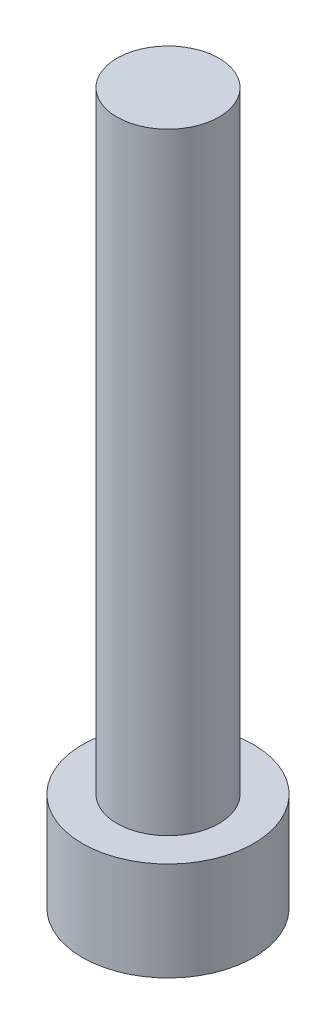
ISO-10303-21;
HEADER;
FILE_DESCRIPTION(('STEP AP214'),'2;1');
FILE_NAME('part.step','',(''),(''),'','','');
FILE_SCHEMA(('AUTOMOTIVE_DESIGN { 1 0 10303 214 1 1 1 1 }'));
ENDSEC;
DATA;
#1=APPLICATION_CONTEXT('core data for automotive mechanical design processes');
#2=APPLICATION_PROTOCOL_DEFINITION('international standard','automotive_design',2000,#1);
#3=PRODUCT_CONTEXT('',#1,'mechanical');
#4=PRODUCT('Part','Part','',(#3));
#5=PRODUCT_RELATED_PRODUCT_CATEGORY('part','',(#4));
#6=PRODUCT_DEFINITION_FORMATION('','',#4);
#7=PRODUCT_DEFINITION_CONTEXT('part definition',#1,'design');
#8=PRODUCT_DEFINITION('design','',#6,#7);
#9=PRODUCT_DEFINITION_SHAPE('','',#8);
#10=(LENGTH_UNIT() NAMED_UNIT(*) SI_UNIT(.MILLI.,.METRE.));
#11=(NAMED_UNIT(*) PLANE_ANGLE_UNIT() SI_UNIT($,.RADIAN.));
#12=(NAMED_UNIT(*) SI_UNIT($,.STERADIAN.) SOLID_ANGLE_UNIT());
#13=UNCERTAINTY_MEASURE_WITH_UNIT(LENGTH_MEASURE(1.E-05),#10,'distance_accuracy_value','');
#14=(GEOMETRIC_REPRESENTATION_CONTEXT(3) GLOBAL_UNCERTAINTY_ASSIGNED_CONTEXT((#13)) GLOBAL_UNIT_ASSIGNED_CONTEXT((#10,
#11,#12)) REPRESENTATION_CONTEXT('',''));
#15=CARTESIAN_POINT('',(0.,0.,0.));
#16=DIRECTION('',(0.,0.,1.));
#17=DIRECTION('',(1.,0.,0.));
#18=AXIS2_PLACEMENT_3D('',#15,#16,#17);
#19=CARTESIAN_POINT('',(0.,4.84,0.));
#20=DIRECTION('',(0.,-1.,0.));
#21=DIRECTION('',(0.,0.,-1.));
#22=AXIS2_PLACEMENT_3D('',#19,#20,#21);
#23=CYLINDRICAL_SURFACE('',#22,4.2);
#24=CARTESIAN_POINT('',(0.,4.84,0.));
#25=DIRECTION('',(0.,1.,0.));
#26=DIRECTION('',(0.,0.,1.));
#27=AXIS2_PLACEMENT_3D('',#24,#25,#26);
#28=CIRCLE('',#27,4.2);
#29=CARTESIAN_POINT('',(0.,4.84,4.2));
#30=VERTEX_POINT('',#29);
#31=EDGE_CURVE('E43',#30,#30,#28,.T.);
#32=ORIENTED_EDGE('',*,*,#31,.F.);
#33=EDGE_LOOP('',(#32));
#34=FACE_BOUND('',#33,.T.);
#35=CARTESIAN_POINT('',(0.,0.,0.));
#36=DIRECTION('',(0.,1.,0.));
#37=DIRECTION('',(0.,0.,1.));
#38=AXIS2_PLACEMENT_3D('',#35,#36,#37);
#39=CIRCLE('',#38,4.2);
#40=CARTESIAN_POINT('',(0.,0.,4.2));
#41=VERTEX_POINT('',#40);
#42=EDGE_CURVE('E38',#41,#41,#39,.T.);
#43=ORIENTED_EDGE('',*,*,#42,.T.);
#44=EDGE_LOOP('',(#43));
#45=FACE_BOUND('',#44,.T.);
#46=ADVANCED_FACE('F35',(#34,#45),#23,.T.);
#47=CARTESIAN_POINT('',(0.,4.84,0.));
#48=DIRECTION('',(0.,1.,0.));
#49=DIRECTION('',(0.,0.,1.));
#50=AXIS2_PLACEMENT_3D('',#47,#48,#49);
#51=PLANE('',#50);
#52=CARTESIAN_POINT('',(0.,4.84,0.));
#53=DIRECTION('',(0.,1.,0.));
#54=DIRECTION('',(0.,0.,1.));
#55=AXIS2_PLACEMENT_3D('',#52,#53,#54);
#56=CIRCLE('',#55,2.5);
#57=CARTESIAN_POINT('',(0.,4.84,2.5));
#58=VERTEX_POINT('',#57);
#59=EDGE_CURVE('E11',#58,#58,#56,.T.);
#60=ORIENTED_EDGE('',*,*,#59,.F.);
#61=EDGE_LOOP('',(#60));
#62=FACE_BOUND('',#61,.T.);
#63=ORIENTED_EDGE('',*,*,#31,.T.);
#64=EDGE_LOOP('',(#63));
#65=FACE_BOUND('',#64,.T.);
#66=ADVANCED_FACE('F155',(#62,#65),#51,.T.);
#67=CARTESIAN_POINT('',(0.,0.,0.));
#68=DIRECTION('',(0.,1.,0.));
#69=DIRECTION('',(0.,0.,1.));
#70=AXIS2_PLACEMENT_3D('',#67,#68,#69);
#71=PLANE('',#70);
#72=DIRECTION('',(-0.5,0.,0.866025403784439));
#73=VECTOR('',#72,1.);
#74=CARTESIAN_POINT('',(2.3,0.,0.));
#75=LINE('',#74,#73);
#76=CARTESIAN_POINT('',(2.3,0.,0.));
#77=VERTEX_POINT('',#76);
#78=CARTESIAN_POINT('',(1.15,0.,1.99185842870421));
#79=VERTEX_POINT('',#78);
#80=EDGE_CURVE('E125',#77,#79,#75,.T.);
#81=ORIENTED_EDGE('',*,*,#80,.F.);
#82=DIRECTION('',(0.5,0.,0.866025403784439));
#83=VECTOR('',#82,1.);
#84=CARTESIAN_POINT('',(1.15,0.,-1.99185842870421));
#85=LINE('',#84,#83);
#86=CARTESIAN_POINT('',(1.15,0.,-1.99185842870421));
#87=VERTEX_POINT('',#86);
#88=EDGE_CURVE('E51',#87,#77,#85,.T.);
#89=ORIENTED_EDGE('',*,*,#88,.F.);
#90=DIRECTION('',(1.,0.,0.));
#91=VECTOR('',#90,1.);
#92=CARTESIAN_POINT('',(-1.15,0.,-1.99185842870421));
#93=LINE('',#92,#91);
#94=CARTESIAN_POINT('',(-1.15,0.,-1.99185842870421));
#95=VERTEX_POINT('',#94);
#96=EDGE_CURVE('E134',#95,#87,#93,.T.);
#97=ORIENTED_EDGE('',*,*,#96,.F.);
#98=DIRECTION('',(0.5,0.,-0.866025403784439));
#99=VECTOR('',#98,1.);
#100=CARTESIAN_POINT('',(-2.3,0.,0.));
#101=LINE('',#100,#99);
#102=CARTESIAN_POINT('',(-2.3,0.,0.));
#103=VERTEX_POINT('',#102);
#104=EDGE_CURVE('E132',#103,#95,#101,.T.);
#105=ORIENTED_EDGE('',*,*,#104,.F.);
#106=DIRECTION('',(-0.5,0.,-0.866025403784439));
#107=VECTOR('',#106,1.);
#108=CARTESIAN_POINT('',(-1.15,0.,1.99185842870421));
#109=LINE('',#108,#107);
#110=CARTESIAN_POINT('',(-1.15,0.,1.99185842870421));
#111=VERTEX_POINT('',#110);
#112=EDGE_CURVE('E99',#111,#103,#109,.T.);
#113=ORIENTED_EDGE('',*,*,#112,.F.);
#114=DIRECTION('',(-1.,0.,0.));
#115=VECTOR('',#114,1.);
#116=CARTESIAN_POINT('',(1.15,0.,1.99185842870421));
#117=LINE('',#116,#115);
#118=EDGE_CURVE('E128',#79,#111,#117,.T.);
#119=ORIENTED_EDGE('',*,*,#118,.F.);
#120=EDGE_LOOP('',(#81,#89,#97,#105,#113,#119));
#121=FACE_BOUND('',#120,.T.);
#122=ORIENTED_EDGE('',*,*,#42,.F.);
#123=EDGE_LOOP('',(#122));
#124=FACE_BOUND('',#123,.T.);
#125=ADVANCED_FACE('F152',(#121,#124),#71,.F.);
#126=CARTESIAN_POINT('',(0.,34.84,0.));
#127=DIRECTION('',(0.,-1.,0.));
#128=DIRECTION('',(0.,0.,-1.));
#129=AXIS2_PLACEMENT_3D('',#126,#127,#128);
#130=CYLINDRICAL_SURFACE('',#129,2.5);
#131=CARTESIAN_POINT('',(0.,34.84,0.));
#132=DIRECTION('',(0.,1.,0.));
#133=DIRECTION('',(0.,0.,1.));
#134=AXIS2_PLACEMENT_3D('',#131,#132,#133);
#135=CIRCLE('',#134,2.5);
#136=CARTESIAN_POINT('',(0.,34.84,2.5));
#137=VERTEX_POINT('',#136);
#138=EDGE_CURVE('E138',#137,#137,#135,.T.);
#139=ORIENTED_EDGE('',*,*,#138,.F.);
#140=EDGE_LOOP('',(#139));
#141=FACE_BOUND('',#140,.T.);
#142=ORIENTED_EDGE('',*,*,#59,.T.);
#143=EDGE_LOOP('',(#142));
#144=FACE_BOUND('',#143,.T.);
#145=ADVANCED_FACE('F154',(#141,#144),#130,.T.);
#146=CARTESIAN_POINT('',(0.,34.84,0.));
#147=DIRECTION('',(0.,1.,0.));
#148=DIRECTION('',(0.,0.,1.));
#149=AXIS2_PLACEMENT_3D('',#146,#147,#148);
#150=PLANE('',#149);
#151=ORIENTED_EDGE('',*,*,#138,.T.);
#152=EDGE_LOOP('',(#151));
#153=FACE_BOUND('',#152,.T.);
#154=ADVANCED_FACE('F161',(#153),#150,.T.);
#155=CARTESIAN_POINT('',(1.15,3.4,-1.99185842870421));
#156=DIRECTION('',(0.866025403784439,0.,-0.5));
#157=DIRECTION('',(-0.5,0.,-0.866025403784439));
#158=AXIS2_PLACEMENT_3D('',#155,#156,#157);
#159=PLANE('',#158);
#160=ORIENTED_EDGE('',*,*,#88,.T.);
#161=DIRECTION('',(0.,-1.,0.));
#162=VECTOR('',#161,1.);
#163=CARTESIAN_POINT('',(2.3,3.4,0.));
#164=LINE('',#163,#162);
#165=CARTESIAN_POINT('',(2.3,3.4,0.));
#166=VERTEX_POINT('',#165);
#167=EDGE_CURVE('E81',#166,#77,#164,.T.);
#168=ORIENTED_EDGE('',*,*,#167,.F.);
#169=DIRECTION('',(0.5,0.,0.866025403784439));
#170=VECTOR('',#169,1.);
#171=CARTESIAN_POINT('',(1.15,3.4,-1.99185842870421));
#172=LINE('',#171,#170);
#173=CARTESIAN_POINT('',(1.15,3.4,-1.99185842870421));
#174=VERTEX_POINT('',#173);
#175=EDGE_CURVE('E136',#174,#166,#172,.T.);
#176=ORIENTED_EDGE('',*,*,#175,.F.);
#177=DIRECTION('',(0.,-1.,0.));
#178=VECTOR('',#177,1.);
#179=CARTESIAN_POINT('',(1.15,3.4,-1.99185842870421));
#180=LINE('',#179,#178);
#181=EDGE_CURVE('E59',#174,#87,#180,.T.);
#182=ORIENTED_EDGE('',*,*,#181,.T.);
#183=EDGE_LOOP('',(#160,#168,#176,#182));
#184=FACE_BOUND('',#183,.T.);
#185=ADVANCED_FACE('F190',(#184),#159,.F.);
#186=CARTESIAN_POINT('',(-1.15,3.4,-1.99185842870421));
#187=DIRECTION('',(0.,0.,-1.));
#188=DIRECTION('',(-1.,0.,0.));
#189=AXIS2_PLACEMENT_3D('',#186,#187,#188);
#190=PLANE('',#189);
#191=ORIENTED_EDGE('',*,*,#96,.T.);
#192=ORIENTED_EDGE('',*,*,#181,.F.);
#193=DIRECTION('',(1.,0.,0.));
#194=VECTOR('',#193,1.);
#195=CARTESIAN_POINT('',(-1.15,3.4,-1.99185842870421));
#196=LINE('',#195,#194);
#197=CARTESIAN_POINT('',(-1.15,3.4,-1.99185842870421));
#198=VERTEX_POINT('',#197);
#199=EDGE_CURVE('E111',#198,#174,#196,.T.);
#200=ORIENTED_EDGE('',*,*,#199,.F.);
#201=DIRECTION('',(0.,-1.,0.));
#202=VECTOR('',#201,1.);
#203=CARTESIAN_POINT('',(-1.15,3.4,-1.99185842870421));
#204=LINE('',#203,#202);
#205=EDGE_CURVE('E103',#198,#95,#204,.T.);
#206=ORIENTED_EDGE('',*,*,#205,.T.);
#207=EDGE_LOOP('',(#191,#192,#200,#206));
#208=FACE_BOUND('',#207,.T.);
#209=ADVANCED_FACE('F204',(#208),#190,.F.);
#210=CARTESIAN_POINT('',(-2.3,3.4,0.));
#211=DIRECTION('',(-0.866025403784439,0.,-0.5));
#212=DIRECTION('',(-0.5,0.,0.866025403784439));
#213=AXIS2_PLACEMENT_3D('',#210,#211,#212);
#214=PLANE('',#213);
#215=ORIENTED_EDGE('',*,*,#104,.T.);
#216=ORIENTED_EDGE('',*,*,#205,.F.);
#217=DIRECTION('',(0.5,0.,-0.866025403784439));
#218=VECTOR('',#217,1.);
#219=CARTESIAN_POINT('',(-2.3,3.4,0.));
#220=LINE('',#219,#218);
#221=CARTESIAN_POINT('',(-2.3,3.4,0.));
#222=VERTEX_POINT('',#221);
#223=EDGE_CURVE('E107',#222,#198,#220,.T.);
#224=ORIENTED_EDGE('',*,*,#223,.F.);
#225=DIRECTION('',(0.,-1.,0.));
#226=VECTOR('',#225,1.);
#227=CARTESIAN_POINT('',(-2.3,3.4,0.));
#228=LINE('',#227,#226);
#229=EDGE_CURVE('E92',#222,#103,#228,.T.);
#230=ORIENTED_EDGE('',*,*,#229,.T.);
#231=EDGE_LOOP('',(#215,#216,#224,#230));
#232=FACE_BOUND('',#231,.T.);
#233=ADVANCED_FACE('F108',(#232),#214,.F.);
#234=CARTESIAN_POINT('',(-1.15,3.4,1.99185842870421));
#235=DIRECTION('',(-0.866025403784439,0.,0.5));
#236=DIRECTION('',(0.5,0.,0.866025403784439));
#237=AXIS2_PLACEMENT_3D('',#234,#235,#236);
#238=PLANE('',#237);
#239=ORIENTED_EDGE('',*,*,#112,.T.);
#240=ORIENTED_EDGE('',*,*,#229,.F.);
#241=DIRECTION('',(-0.5,0.,-0.866025403784439));
#242=VECTOR('',#241,1.);
#243=CARTESIAN_POINT('',(-1.15,3.4,1.99185842870421));
#244=LINE('',#243,#242);
#245=CARTESIAN_POINT('',(-1.15,3.4,1.99185842870421));
#246=VERTEX_POINT('',#245);
#247=EDGE_CURVE('E96',#246,#222,#244,.T.);
#248=ORIENTED_EDGE('',*,*,#247,.F.);
#249=DIRECTION('',(0.,-1.,0.));
#250=VECTOR('',#249,1.);
#251=CARTESIAN_POINT('',(-1.15,3.4,1.99185842870421));
#252=LINE('',#251,#250);
#253=EDGE_CURVE('E104',#246,#111,#252,.T.);
#254=ORIENTED_EDGE('',*,*,#253,.T.);
#255=EDGE_LOOP('',(#239,#240,#248,#254));
#256=FACE_BOUND('',#255,.T.);
#257=ADVANCED_FACE('F94',(#256),#238,.F.);
#258=CARTESIAN_POINT('',(1.15,3.4,1.99185842870421));
#259=DIRECTION('',(0.,0.,1.));
#260=DIRECTION('',(1.,0.,0.));
#261=AXIS2_PLACEMENT_3D('',#258,#259,#260);
#262=PLANE('',#261);
#263=ORIENTED_EDGE('',*,*,#118,.T.);
#264=ORIENTED_EDGE('',*,*,#253,.F.);
#265=DIRECTION('',(-1.,0.,0.));
#266=VECTOR('',#265,1.);
#267=CARTESIAN_POINT('',(1.15,3.4,1.99185842870421));
#268=LINE('',#267,#266);
#269=CARTESIAN_POINT('',(1.15,3.4,1.99185842870421));
#270=VERTEX_POINT('',#269);
#271=EDGE_CURVE('E117',#270,#246,#268,.T.);
#272=ORIENTED_EDGE('',*,*,#271,.F.);
#273=DIRECTION('',(0.,-1.,0.));
#274=VECTOR('',#273,1.);
#275=CARTESIAN_POINT('',(1.15,3.4,1.99185842870421));
#276=LINE('',#275,#274);
#277=EDGE_CURVE('E141',#270,#79,#276,.T.);
#278=ORIENTED_EDGE('',*,*,#277,.T.);
#279=EDGE_LOOP('',(#263,#264,#272,#278));
#280=FACE_BOUND('',#279,.T.);
#281=ADVANCED_FACE('F229',(#280),#262,.F.);
#282=CARTESIAN_POINT('',(2.3,3.4,0.));
#283=DIRECTION('',(0.866025403784439,0.,0.5));
#284=DIRECTION('',(0.5,0.,-0.866025403784439));
#285=AXIS2_PLACEMENT_3D('',#282,#283,#284);
#286=PLANE('',#285);
#287=ORIENTED_EDGE('',*,*,#80,.T.);
#288=ORIENTED_EDGE('',*,*,#277,.F.);
#289=DIRECTION('',(-0.5,0.,0.866025403784439));
#290=VECTOR('',#289,1.);
#291=CARTESIAN_POINT('',(2.3,3.4,0.));
#292=LINE('',#291,#290);
#293=EDGE_CURVE('E119',#166,#270,#292,.T.);
#294=ORIENTED_EDGE('',*,*,#293,.F.);
#295=ORIENTED_EDGE('',*,*,#167,.T.);
#296=EDGE_LOOP('',(#287,#288,#294,#295));
#297=FACE_BOUND('',#296,.T.);
#298=ADVANCED_FACE('F238',(#297),#286,.F.);
#299=CARTESIAN_POINT('',(0.,3.4,0.));
#300=DIRECTION('',(0.,-1.,0.));
#301=DIRECTION('',(0.,0.,-1.));
#302=AXIS2_PLACEMENT_3D('',#299,#300,#301);
#303=PLANE('',#302);
#304=ORIENTED_EDGE('',*,*,#175,.T.);
#305=ORIENTED_EDGE('',*,*,#293,.T.);
#306=ORIENTED_EDGE('',*,*,#271,.T.);
#307=ORIENTED_EDGE('',*,*,#247,.T.);
#308=ORIENTED_EDGE('',*,*,#223,.T.);
#309=ORIENTED_EDGE('',*,*,#199,.T.);
#310=EDGE_LOOP('',(#304,#305,#306,#307,#308,#309));
#311=FACE_BOUND('',#310,.T.);
#312=ADVANCED_FACE('F114',(#311),#303,.T.);
#313=CLOSED_SHELL('',(#46,#66,#125,#145,#154,#185,#209,#233,#257,#281,#298,#312));
#314=MANIFOLD_SOLID_BREP('B2',#313);
#315=ADVANCED_BREP_SHAPE_REPRESENTATION('',(#18,#314),#14);
#316=SHAPE_DEFINITION_REPRESENTATION(#9,#315);
ENDSEC;
END-ISO-10303-21;
